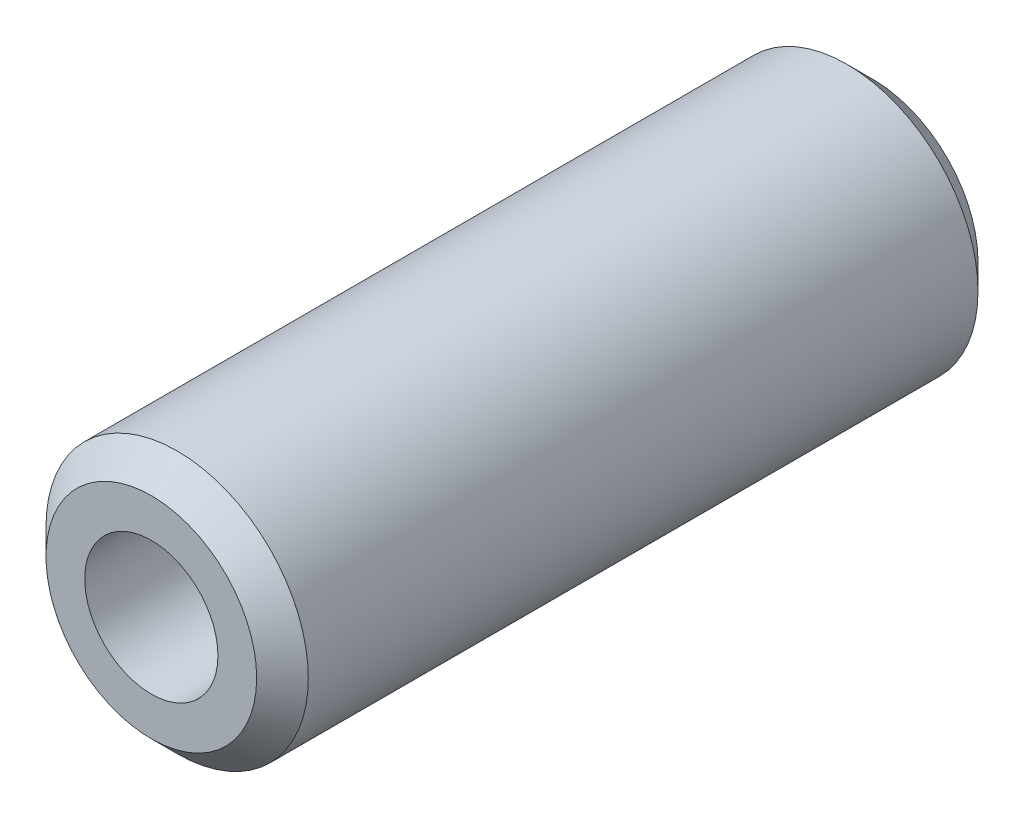
ISO-10303-21;
HEADER;
FILE_DESCRIPTION(('STEP AP214'),'2;1');
FILE_NAME('part.step','',(''),(''),'','','');
FILE_SCHEMA(('AUTOMOTIVE_DESIGN { 1 0 10303 214 1 1 1 1 }'));
ENDSEC;
DATA;
#1=APPLICATION_CONTEXT('core data for automotive mechanical design processes');
#2=APPLICATION_PROTOCOL_DEFINITION('international standard','automotive_design',2000,#1);
#3=PRODUCT_CONTEXT('',#1,'mechanical');
#4=PRODUCT('Part','Part','',(#3));
#5=PRODUCT_RELATED_PRODUCT_CATEGORY('part','',(#4));
#6=PRODUCT_DEFINITION_FORMATION('','',#4);
#7=PRODUCT_DEFINITION_CONTEXT('part definition',#1,'design');
#8=PRODUCT_DEFINITION('design','',#6,#7);
#9=PRODUCT_DEFINITION_SHAPE('','',#8);
#10=(LENGTH_UNIT() NAMED_UNIT(*) SI_UNIT(.MILLI.,.METRE.));
#11=(NAMED_UNIT(*) PLANE_ANGLE_UNIT() SI_UNIT($,.RADIAN.));
#12=(NAMED_UNIT(*) SI_UNIT($,.STERADIAN.) SOLID_ANGLE_UNIT());
#13=UNCERTAINTY_MEASURE_WITH_UNIT(LENGTH_MEASURE(1.E-05),#10,'distance_accuracy_value','');
#14=(GEOMETRIC_REPRESENTATION_CONTEXT(3) GLOBAL_UNCERTAINTY_ASSIGNED_CONTEXT((#13)) GLOBAL_UNIT_ASSIGNED_CONTEXT((#10,
#11,#12)) REPRESENTATION_CONTEXT('',''));
#15=CARTESIAN_POINT('',(0.,0.,0.));
#16=DIRECTION('',(0.,0.,1.));
#17=DIRECTION('',(1.,0.,0.));
#18=AXIS2_PLACEMENT_3D('',#15,#16,#17);
#19=CARTESIAN_POINT('',(0.,0.,69.85));
#20=DIRECTION('',(0.,0.,-1.));
#21=DIRECTION('',(-1.,0.,0.));
#22=AXIS2_PLACEMENT_3D('',#19,#20,#21);
#23=CYLINDRICAL_SURFACE('',#22,12.7);
#24=CARTESIAN_POINT('',(0.,0.,2.5));
#25=DIRECTION('',(0.,0.,1.));
#26=DIRECTION('',(1.,0.,0.));
#27=AXIS2_PLACEMENT_3D('',#24,#25,#26);
#28=CIRCLE('',#27,12.7);
#29=CARTESIAN_POINT('',(12.7,0.,2.5));
#30=VERTEX_POINT('',#29);
#31=EDGE_CURVE('E59',#30,#30,#28,.T.);
#32=ORIENTED_EDGE('',*,*,#31,.T.);
#33=EDGE_LOOP('',(#32));
#34=FACE_BOUND('',#33,.T.);
#35=CARTESIAN_POINT('',(0.,0.,67.35));
#36=DIRECTION('',(0.,0.,1.));
#37=DIRECTION('',(1.,0.,0.));
#38=AXIS2_PLACEMENT_3D('',#35,#36,#37);
#39=CIRCLE('',#38,12.7);
#40=CARTESIAN_POINT('',(12.7,0.,67.35));
#41=VERTEX_POINT('',#40);
#42=EDGE_CURVE('E64',#41,#41,#39,.F.);
#43=ORIENTED_EDGE('',*,*,#42,.T.);
#44=EDGE_LOOP('',(#43));
#45=FACE_BOUND('',#44,.T.);
#46=ADVANCED_FACE('F45',(#34,#45),#23,.T.);
#47=CARTESIAN_POINT('',(0.,0.,69.85));
#48=DIRECTION('',(0.,0.,1.));
#49=DIRECTION('',(1.,0.,0.));
#50=AXIS2_PLACEMENT_3D('',#47,#48,#49);
#51=PLANE('',#50);
#52=CARTESIAN_POINT('',(0.,0.,69.85));
#53=DIRECTION('',(0.,0.,1.));
#54=DIRECTION('',(1.,0.,0.));
#55=AXIS2_PLACEMENT_3D('',#52,#53,#54);
#56=CIRCLE('',#55,10.2);
#57=CARTESIAN_POINT('',(10.2,0.,69.85));
#58=VERTEX_POINT('',#57);
#59=EDGE_CURVE('E10',#58,#58,#56,.T.);
#60=ORIENTED_EDGE('',*,*,#59,.T.);
#61=EDGE_LOOP('',(#60));
#62=FACE_BOUND('',#61,.T.);
#63=CARTESIAN_POINT('',(0.,0.,69.85));
#64=DIRECTION('',(0.,0.,1.));
#65=DIRECTION('',(1.,0.,0.));
#66=AXIS2_PLACEMENT_3D('',#63,#64,#65);
#67=CIRCLE('',#66,6.45);
#68=CARTESIAN_POINT('',(6.45,0.,69.85));
#69=VERTEX_POINT('',#68);
#70=EDGE_CURVE('E70',#69,#69,#67,.T.);
#71=ORIENTED_EDGE('',*,*,#70,.F.);
#72=EDGE_LOOP('',(#71));
#73=FACE_BOUND('',#72,.T.);
#74=ADVANCED_FACE('F91',(#62,#73),#51,.T.);
#75=CARTESIAN_POINT('',(0.,0.,0.));
#76=DIRECTION('',(0.,0.,1.));
#77=DIRECTION('',(1.,0.,0.));
#78=AXIS2_PLACEMENT_3D('',#75,#76,#77);
#79=PLANE('',#78);
#80=CARTESIAN_POINT('',(0.,0.,0.));
#81=DIRECTION('',(0.,0.,1.));
#82=DIRECTION('',(1.,0.,0.));
#83=AXIS2_PLACEMENT_3D('',#80,#81,#82);
#84=CIRCLE('',#83,10.2);
#85=CARTESIAN_POINT('',(10.2,0.,0.));
#86=VERTEX_POINT('',#85);
#87=EDGE_CURVE('E54',#86,#86,#84,.F.);
#88=ORIENTED_EDGE('',*,*,#87,.T.);
#89=EDGE_LOOP('',(#88));
#90=FACE_BOUND('',#89,.T.);
#91=CARTESIAN_POINT('',(0.,0.,0.));
#92=DIRECTION('',(0.,0.,1.));
#93=DIRECTION('',(1.,0.,0.));
#94=AXIS2_PLACEMENT_3D('',#91,#92,#93);
#95=CIRCLE('',#94,6.45);
#96=CARTESIAN_POINT('',(6.45,0.,0.));
#97=VERTEX_POINT('',#96);
#98=EDGE_CURVE('E74',#97,#97,#95,.T.);
#99=ORIENTED_EDGE('',*,*,#98,.T.);
#100=EDGE_LOOP('',(#99));
#101=FACE_BOUND('',#100,.T.);
#102=ADVANCED_FACE('F79',(#90,#101),#79,.F.);
#103=CARTESIAN_POINT('',(0.,0.,0.));
#104=DIRECTION('',(0.,0.,1.));
#105=DIRECTION('',(1.,0.,0.));
#106=AXIS2_PLACEMENT_3D('',#103,#104,#105);
#107=CYLINDRICAL_SURFACE('',#106,6.45);
#108=ORIENTED_EDGE('',*,*,#70,.T.);
#109=EDGE_LOOP('',(#108));
#110=FACE_BOUND('',#109,.T.);
#111=ORIENTED_EDGE('',*,*,#98,.F.);
#112=EDGE_LOOP('',(#111));
#113=FACE_BOUND('',#112,.T.);
#114=ADVANCED_FACE('F81',(#110,#113),#107,.F.);
#115=CARTESIAN_POINT('',(0.,0.,2.5));
#116=DIRECTION('',(0.,0.,1.));
#117=DIRECTION('',(1.,0.,0.));
#118=AXIS2_PLACEMENT_3D('',#115,#116,#117);
#119=CONICAL_SURFACE('',#118,12.7,0.785398163397453);
#120=ORIENTED_EDGE('',*,*,#87,.F.);
#121=EDGE_LOOP('',(#120));
#122=FACE_BOUND('',#121,.T.);
#123=ORIENTED_EDGE('',*,*,#31,.F.);
#124=EDGE_LOOP('',(#123));
#125=FACE_BOUND('',#124,.T.);
#126=ADVANCED_FACE('F83',(#122,#125),#119,.T.);
#127=CARTESIAN_POINT('',(0.,0.,69.85));
#128=DIRECTION('',(0.,0.,-1.));
#129=DIRECTION('',(-1.,0.,0.));
#130=AXIS2_PLACEMENT_3D('',#127,#128,#129);
#131=CONICAL_SURFACE('',#130,10.2,0.785398163397448);
#132=ORIENTED_EDGE('',*,*,#42,.F.);
#133=EDGE_LOOP('',(#132));
#134=FACE_BOUND('',#133,.T.);
#135=ORIENTED_EDGE('',*,*,#59,.F.);
#136=EDGE_LOOP('',(#135));
#137=FACE_BOUND('',#136,.T.);
#138=ADVANCED_FACE('F48',(#134,#137),#131,.T.);
#139=CLOSED_SHELL('',(#46,#74,#102,#114,#126,#138));
#140=MANIFOLD_SOLID_BREP('B2',#139);
#141=ADVANCED_BREP_SHAPE_REPRESENTATION('',(#18,#140),#14);
#142=SHAPE_DEFINITION_REPRESENTATION(#9,#141);
ENDSEC;
END-ISO-10303-21;
